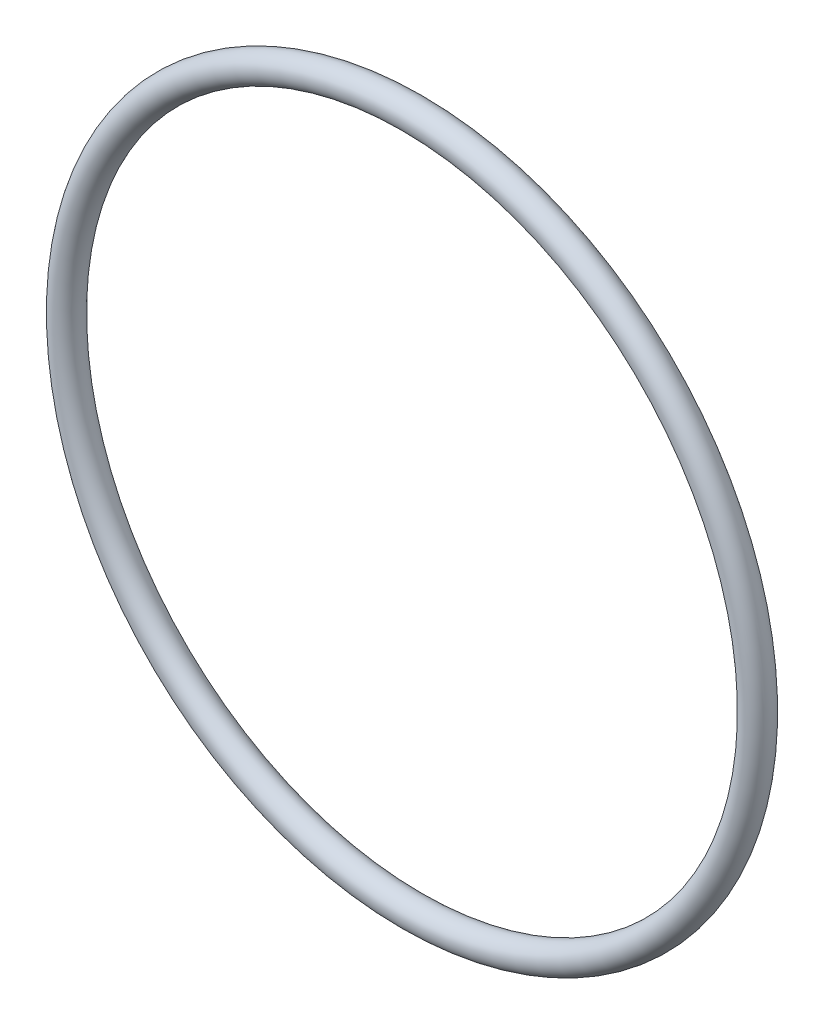
ISO-10303-21;
HEADER;
FILE_DESCRIPTION(('STEP AP214'),'2;1');
FILE_NAME('part.step','',(''),(''),'','','');
FILE_SCHEMA(('AUTOMOTIVE_DESIGN { 1 0 10303 214 1 1 1 1 }'));
ENDSEC;
DATA;
#1=APPLICATION_CONTEXT('core data for automotive mechanical design processes');
#2=APPLICATION_PROTOCOL_DEFINITION('international standard','automotive_design',2000,#1);
#3=PRODUCT_CONTEXT('',#1,'mechanical');
#4=PRODUCT('Part','Part','',(#3));
#5=PRODUCT_RELATED_PRODUCT_CATEGORY('part','',(#4));
#6=PRODUCT_DEFINITION_FORMATION('','',#4);
#7=PRODUCT_DEFINITION_CONTEXT('part definition',#1,'design');
#8=PRODUCT_DEFINITION('design','',#6,#7);
#9=PRODUCT_DEFINITION_SHAPE('','',#8);
#10=(LENGTH_UNIT() NAMED_UNIT(*) SI_UNIT(.MILLI.,.METRE.));
#11=(NAMED_UNIT(*) PLANE_ANGLE_UNIT() SI_UNIT($,.RADIAN.));
#12=(NAMED_UNIT(*) SI_UNIT($,.STERADIAN.) SOLID_ANGLE_UNIT());
#13=UNCERTAINTY_MEASURE_WITH_UNIT(LENGTH_MEASURE(1.E-05),#10,'distance_accuracy_value','');
#14=(GEOMETRIC_REPRESENTATION_CONTEXT(3) GLOBAL_UNCERTAINTY_ASSIGNED_CONTEXT((#13)) GLOBAL_UNIT_ASSIGNED_CONTEXT((#10,
#11,#12)) REPRESENTATION_CONTEXT('',''));
#15=CARTESIAN_POINT('',(0.,0.,0.));
#16=DIRECTION('',(0.,0.,1.));
#17=DIRECTION('',(1.,0.,0.));
#18=AXIS2_PLACEMENT_3D('',#15,#16,#17);
#19=CARTESIAN_POINT('',(0.,0.,0.));
#20=DIRECTION('',(0.,0.,1.));
#21=DIRECTION('',(1.,0.,0.));
#22=AXIS2_PLACEMENT_3D('',#19,#20,#21);
#23=TOROIDAL_SURFACE('',#22,60.7499999999996,2.5);
#24=CARTESIAN_POINT('',(0.,60.7499999999996,0.));
#25=DIRECTION('',(1.,0.,0.));
#26=DIRECTION('',(0.,0.,-1.));
#27=AXIS2_PLACEMENT_3D('',#24,#25,#26);
#28=CIRCLE('',#27,2.5);
#29=CARTESIAN_POINT('',(0.,63.2499999999997,0.));
#30=VERTEX_POINT('',#29);
#31=EDGE_CURVE('E10',#30,#30,#28,.T.);
#32=CARTESIAN_POINT('',(0.,0.,0.));
#33=DIRECTION('',(0.,0.,1.));
#34=DIRECTION('',(1.,0.,0.));
#35=AXIS2_PLACEMENT_3D('',#32,#33,#34);
#36=CIRCLE('',#35,63.2499999999997);
#37=EDGE_CURVE('',#30,#30,#36,.T.);
#38=ORIENTED_EDGE('',*,*,#31,.F.);
#39=ORIENTED_EDGE('',*,*,#31,.T.);
#40=ORIENTED_EDGE('',*,*,#37,.T.);
#41=ORIENTED_EDGE('',*,*,#37,.F.);
#42=EDGE_LOOP('',(#38,#40,#39,#41));
#43=FACE_BOUND('',#42,.T.);
#44=ADVANCED_FACE('F31',(#43),#23,.T.);
#45=CLOSED_SHELL('',(#44));
#46=MANIFOLD_SOLID_BREP('B2',#45);
#47=ADVANCED_BREP_SHAPE_REPRESENTATION('',(#18,#46),#14);
#48=SHAPE_DEFINITION_REPRESENTATION(#9,#47);
ENDSEC;
END-ISO-10303-21;
